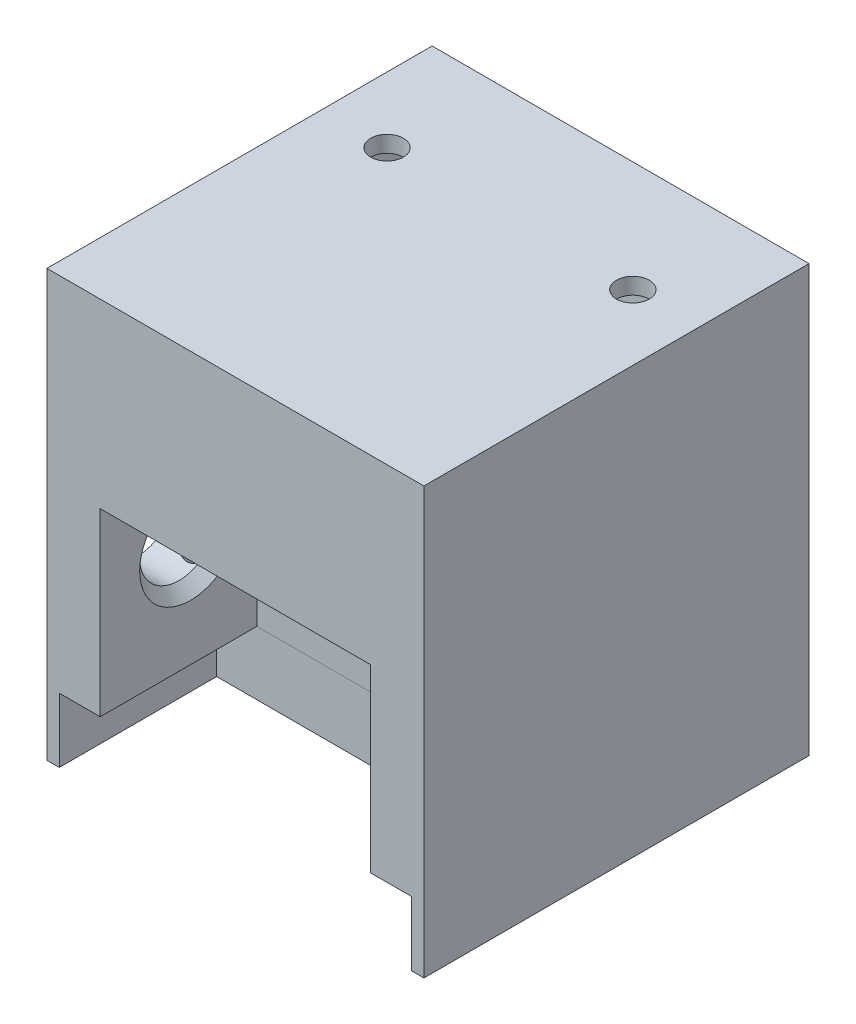
ISO-10303-21;
HEADER;
FILE_DESCRIPTION(('STEP AP214'),'2;1');
FILE_NAME('part.step','',(''),(''),'','','');
FILE_SCHEMA(('AUTOMOTIVE_DESIGN { 1 0 10303 214 1 1 1 1 }'));
ENDSEC;
DATA;
#1=APPLICATION_CONTEXT('core data for automotive mechanical design processes');
#2=APPLICATION_PROTOCOL_DEFINITION('international standard','automotive_design',2000,#1);
#3=PRODUCT_CONTEXT('',#1,'mechanical');
#4=PRODUCT('Part','Part','',(#3));
#5=PRODUCT_RELATED_PRODUCT_CATEGORY('part','',(#4));
#6=PRODUCT_DEFINITION_FORMATION('','',#4);
#7=PRODUCT_DEFINITION_CONTEXT('part definition',#1,'design');
#8=PRODUCT_DEFINITION('design','',#6,#7);
#9=PRODUCT_DEFINITION_SHAPE('','',#8);
#10=(LENGTH_UNIT() NAMED_UNIT(*) SI_UNIT(.MILLI.,.METRE.));
#11=(NAMED_UNIT(*) PLANE_ANGLE_UNIT() SI_UNIT($,.RADIAN.));
#12=(NAMED_UNIT(*) SI_UNIT($,.STERADIAN.) SOLID_ANGLE_UNIT());
#13=UNCERTAINTY_MEASURE_WITH_UNIT(LENGTH_MEASURE(1.E-05),#10,'distance_accuracy_value','');
#14=(GEOMETRIC_REPRESENTATION_CONTEXT(3) GLOBAL_UNCERTAINTY_ASSIGNED_CONTEXT((#13)) GLOBAL_UNIT_ASSIGNED_CONTEXT((#10,
#11,#12)) REPRESENTATION_CONTEXT('',''));
#15=CARTESIAN_POINT('',(0.,0.,0.));
#16=DIRECTION('',(0.,0.,1.));
#17=DIRECTION('',(1.,0.,0.));
#18=AXIS2_PLACEMENT_3D('',#15,#16,#17);
#19=CARTESIAN_POINT('',(0.,63.5,42.545));
#20=DIRECTION('',(0.,0.,-1.));
#21=DIRECTION('',(-1.,0.,0.));
#22=AXIS2_PLACEMENT_3D('',#19,#20,#21);
#23=PLANE('',#22);
#24=DIRECTION('',(1.,0.,0.));
#25=VECTOR('',#24,1.);
#26=CARTESIAN_POINT('',(20.955,9.979406,42.545));
#27=LINE('',#26,#25);
#28=CARTESIAN_POINT('',(20.955,9.979406,42.545));
#29=VERTEX_POINT('',#28);
#30=CARTESIAN_POINT('',(27.305,9.979406,42.545));
#31=VERTEX_POINT('',#30);
#32=EDGE_CURVE('E233',#29,#31,#27,.T.);
#33=ORIENTED_EDGE('',*,*,#32,.T.);
#34=DIRECTION('',(0.,-1.,0.));
#35=VECTOR('',#34,1.);
#36=CARTESIAN_POINT('',(27.305,9.979406,42.545));
#37=LINE('',#36,#35);
#38=CARTESIAN_POINT('',(27.305,0.,42.545));
#39=VERTEX_POINT('',#38);
#40=EDGE_CURVE('E218',#31,#39,#37,.T.);
#41=ORIENTED_EDGE('',*,*,#40,.T.);
#42=DIRECTION('',(1.,0.,0.));
#43=VECTOR('',#42,1.);
#44=CARTESIAN_POINT('',(0.,0.,42.545));
#45=LINE('',#44,#43);
#46=CARTESIAN_POINT('',(29.21,0.,42.545));
#47=VERTEX_POINT('',#46);
#48=EDGE_CURVE('E229',#39,#47,#45,.T.);
#49=ORIENTED_EDGE('',*,*,#48,.T.);
#50=DIRECTION('',(0.,-1.,0.));
#51=VECTOR('',#50,1.);
#52=CARTESIAN_POINT('',(29.21,63.5,42.545));
#53=LINE('',#52,#51);
#54=CARTESIAN_POINT('',(29.21,66.04,42.545));
#55=VERTEX_POINT('',#54);
#56=EDGE_CURVE('E265',#55,#47,#53,.T.);
#57=ORIENTED_EDGE('',*,*,#56,.F.);
#58=DIRECTION('',(1.,0.,0.));
#59=VECTOR('',#58,1.);
#60=CARTESIAN_POINT('',(0.,66.04,42.545));
#61=LINE('',#60,#59);
#62=CARTESIAN_POINT('',(-29.21,66.04,42.545));
#63=VERTEX_POINT('',#62);
#64=EDGE_CURVE('E463',#63,#55,#61,.T.);
#65=ORIENTED_EDGE('',*,*,#64,.F.);
#66=DIRECTION('',(0.,-1.,0.));
#67=VECTOR('',#66,1.);
#68=CARTESIAN_POINT('',(-29.21,63.5,42.545));
#69=LINE('',#68,#67);
#70=CARTESIAN_POINT('',(-29.21,0.,42.545));
#71=VERTEX_POINT('',#70);
#72=EDGE_CURVE('E258',#63,#71,#69,.T.);
#73=ORIENTED_EDGE('',*,*,#72,.T.);
#74=CARTESIAN_POINT('',(-27.305,0.,42.545));
#75=VERTEX_POINT('',#74);
#76=EDGE_CURVE('E242',#71,#75,#45,.T.);
#77=ORIENTED_EDGE('',*,*,#76,.T.);
#78=DIRECTION('',(0.,1.,0.));
#79=VECTOR('',#78,1.);
#80=CARTESIAN_POINT('',(-27.305,0.,42.545));
#81=LINE('',#80,#79);
#82=CARTESIAN_POINT('',(-27.305,9.979406,42.545));
#83=VERTEX_POINT('',#82);
#84=EDGE_CURVE('E234',#75,#83,#81,.T.);
#85=ORIENTED_EDGE('',*,*,#84,.T.);
#86=DIRECTION('',(1.,0.,0.));
#87=VECTOR('',#86,1.);
#88=CARTESIAN_POINT('',(-27.305,9.979406,42.545));
#89=LINE('',#88,#87);
#90=CARTESIAN_POINT('',(-20.955,9.979406,42.545));
#91=VERTEX_POINT('',#90);
#92=EDGE_CURVE('E546',#83,#91,#89,.T.);
#93=ORIENTED_EDGE('',*,*,#92,.T.);
#94=DIRECTION('',(0.,1.,0.));
#95=VECTOR('',#94,1.);
#96=CARTESIAN_POINT('',(-20.955,9.979406,42.545));
#97=LINE('',#96,#95);
#98=CARTESIAN_POINT('',(-20.955,37.919406,42.545));
#99=VERTEX_POINT('',#98);
#100=EDGE_CURVE('E537',#91,#99,#97,.T.);
#101=ORIENTED_EDGE('',*,*,#100,.T.);
#102=DIRECTION('',(1.,0.,0.));
#103=VECTOR('',#102,1.);
#104=CARTESIAN_POINT('',(-20.955,37.919406,42.545));
#105=LINE('',#104,#103);
#106=CARTESIAN_POINT('',(20.955,37.919406,42.545));
#107=VERTEX_POINT('',#106);
#108=EDGE_CURVE('E533',#99,#107,#105,.T.);
#109=ORIENTED_EDGE('',*,*,#108,.T.);
#110=DIRECTION('',(0.,-1.,0.));
#111=VECTOR('',#110,1.);
#112=CARTESIAN_POINT('',(20.955,37.919406,42.545));
#113=LINE('',#112,#111);
#114=EDGE_CURVE('E543',#107,#29,#113,.T.);
#115=ORIENTED_EDGE('',*,*,#114,.T.);
#116=EDGE_LOOP('',(#33,#41,#49,#57,#65,#73,#77,#85,#93,#101,#109,#115));
#117=FACE_BOUND('',#116,.T.);
#118=ADVANCED_FACE('F62',(#117),#23,.F.);
#119=CARTESIAN_POINT('',(29.21,63.5,0.));
#120=DIRECTION('',(-1.,0.,0.));
#121=DIRECTION('',(0.,0.,1.));
#122=AXIS2_PLACEMENT_3D('',#119,#120,#121);
#123=PLANE('',#122);
#124=DIRECTION('',(0.,0.,-1.));
#125=VECTOR('',#124,1.);
#126=CARTESIAN_POINT('',(29.21,0.,0.));
#127=LINE('',#126,#125);
#128=CARTESIAN_POINT('',(29.21,0.,-17.145));
#129=VERTEX_POINT('',#128);
#130=EDGE_CURVE('E240',#47,#129,#127,.T.);
#131=ORIENTED_EDGE('',*,*,#130,.T.);
#132=DIRECTION('',(0.,-1.,0.));
#133=VECTOR('',#132,1.);
#134=CARTESIAN_POINT('',(29.21,63.5,-17.145));
#135=LINE('',#134,#133);
#136=CARTESIAN_POINT('',(29.21,66.04,-17.145));
#137=VERTEX_POINT('',#136);
#138=EDGE_CURVE('E263',#137,#129,#135,.T.);
#139=ORIENTED_EDGE('',*,*,#138,.F.);
#140=DIRECTION('',(0.,0.,-1.));
#141=VECTOR('',#140,1.);
#142=CARTESIAN_POINT('',(29.21,66.04,0.));
#143=LINE('',#142,#141);
#144=EDGE_CURVE('E417',#55,#137,#143,.T.);
#145=ORIENTED_EDGE('',*,*,#144,.F.);
#146=ORIENTED_EDGE('',*,*,#56,.T.);
#147=EDGE_LOOP('',(#131,#139,#145,#146));
#148=FACE_BOUND('',#147,.T.);
#149=ADVANCED_FACE('F360',(#148),#123,.F.);
#150=CARTESIAN_POINT('',(0.,63.5,-17.145));
#151=DIRECTION('',(0.,0.,-1.));
#152=DIRECTION('',(-1.,0.,0.));
#153=AXIS2_PLACEMENT_3D('',#150,#151,#152);
#154=PLANE('',#153);
#155=DIRECTION('',(1.,0.,0.));
#156=VECTOR('',#155,1.);
#157=CARTESIAN_POINT('',(0.,0.,-17.145));
#158=LINE('',#157,#156);
#159=CARTESIAN_POINT('',(-29.21,0.,-17.145));
#160=VERTEX_POINT('',#159);
#161=EDGE_CURVE('E252',#160,#129,#158,.T.);
#162=ORIENTED_EDGE('',*,*,#161,.F.);
#163=DIRECTION('',(0.,-1.,0.));
#164=VECTOR('',#163,1.);
#165=CARTESIAN_POINT('',(-29.21,63.5,-17.145));
#166=LINE('',#165,#164);
#167=CARTESIAN_POINT('',(-29.21,66.04,-17.145));
#168=VERTEX_POINT('',#167);
#169=EDGE_CURVE('E260',#168,#160,#166,.T.);
#170=ORIENTED_EDGE('',*,*,#169,.F.);
#171=DIRECTION('',(-1.,0.,0.));
#172=VECTOR('',#171,1.);
#173=CARTESIAN_POINT('',(0.,66.04,-17.145));
#174=LINE('',#173,#172);
#175=EDGE_CURVE('E411',#137,#168,#174,.T.);
#176=ORIENTED_EDGE('',*,*,#175,.F.);
#177=ORIENTED_EDGE('',*,*,#138,.T.);
#178=EDGE_LOOP('',(#162,#170,#176,#177));
#179=FACE_BOUND('',#178,.T.);
#180=ADVANCED_FACE('F365',(#179),#154,.T.);
#181=CARTESIAN_POINT('',(0.,63.5,12.065));
#182=DIRECTION('',(0.,0.,-1.));
#183=DIRECTION('',(-1.,0.,0.));
#184=AXIS2_PLACEMENT_3D('',#181,#182,#183);
#185=PLANE('',#184);
#186=DIRECTION('',(1.,0.,0.));
#187=VECTOR('',#186,1.);
#188=CARTESIAN_POINT('',(0.,0.,12.065));
#189=LINE('',#188,#187);
#190=CARTESIAN_POINT('',(1.27,0.,12.065));
#191=VERTEX_POINT('',#190);
#192=CARTESIAN_POINT('',(24.13,0.,12.065));
#193=VERTEX_POINT('',#192);
#194=EDGE_CURVE('E426',#191,#193,#189,.T.);
#195=ORIENTED_EDGE('',*,*,#194,.F.);
#196=DIRECTION('',(0.,-1.,0.));
#197=VECTOR('',#196,1.);
#198=CARTESIAN_POINT('',(1.27,63.5,12.065));
#199=LINE('',#198,#197);
#200=CARTESIAN_POINT('',(1.27,63.5,12.065));
#201=VERTEX_POINT('',#200);
#202=EDGE_CURVE('E261',#201,#191,#199,.T.);
#203=ORIENTED_EDGE('',*,*,#202,.F.);
#204=DIRECTION('',(1.,0.,0.));
#205=VECTOR('',#204,1.);
#206=CARTESIAN_POINT('',(0.,63.5,12.065));
#207=LINE('',#206,#205);
#208=CARTESIAN_POINT('',(24.13,63.5,12.065));
#209=VERTEX_POINT('',#208);
#210=EDGE_CURVE('E447',#201,#209,#207,.T.);
#211=ORIENTED_EDGE('',*,*,#210,.T.);
#212=DIRECTION('',(0.,-1.,0.));
#213=VECTOR('',#212,1.);
#214=CARTESIAN_POINT('',(24.13,63.5,12.065));
#215=LINE('',#214,#213);
#216=EDGE_CURVE('E268',#209,#193,#215,.T.);
#217=ORIENTED_EDGE('',*,*,#216,.T.);
#218=EDGE_LOOP('',(#195,#203,#211,#217));
#219=FACE_BOUND('',#218,.T.);
#220=ADVANCED_FACE('F384',(#219),#185,.T.);
#221=CARTESIAN_POINT('',(1.27,63.5,0.));
#222=DIRECTION('',(1.,0.,0.));
#223=DIRECTION('',(0.,0.,-1.));
#224=AXIS2_PLACEMENT_3D('',#221,#222,#223);
#225=PLANE('',#224);
#226=DIRECTION('',(0.,0.,1.));
#227=VECTOR('',#226,1.);
#228=CARTESIAN_POINT('',(1.27,0.,0.));
#229=LINE('',#228,#227);
#230=CARTESIAN_POINT('',(1.27,0.,-12.065));
#231=VERTEX_POINT('',#230);
#232=EDGE_CURVE('E429',#231,#191,#229,.T.);
#233=ORIENTED_EDGE('',*,*,#232,.F.);
#234=DIRECTION('',(0.,-1.,0.));
#235=VECTOR('',#234,1.);
#236=CARTESIAN_POINT('',(1.27,63.5,-12.065));
#237=LINE('',#236,#235);
#238=CARTESIAN_POINT('',(1.27,63.5,-12.065));
#239=VERTEX_POINT('',#238);
#240=EDGE_CURVE('E273',#239,#231,#237,.T.);
#241=ORIENTED_EDGE('',*,*,#240,.F.);
#242=DIRECTION('',(0.,0.,1.));
#243=VECTOR('',#242,1.);
#244=CARTESIAN_POINT('',(1.27,63.5,0.));
#245=LINE('',#244,#243);
#246=EDGE_CURVE('E445',#239,#201,#245,.T.);
#247=ORIENTED_EDGE('',*,*,#246,.T.);
#248=ORIENTED_EDGE('',*,*,#202,.T.);
#249=EDGE_LOOP('',(#233,#241,#247,#248));
#250=FACE_BOUND('',#249,.T.);
#251=ADVANCED_FACE('F380',(#250),#225,.T.);
#252=CARTESIAN_POINT('',(0.,63.5,-12.065));
#253=DIRECTION('',(0.,0.,-1.));
#254=DIRECTION('',(-1.,0.,0.));
#255=AXIS2_PLACEMENT_3D('',#252,#253,#254);
#256=PLANE('',#255);
#257=DIRECTION('',(1.,0.,0.));
#258=VECTOR('',#257,1.);
#259=CARTESIAN_POINT('',(0.,0.,-12.065));
#260=LINE('',#259,#258);
#261=CARTESIAN_POINT('',(24.13,0.,-12.065));
#262=VERTEX_POINT('',#261);
#263=EDGE_CURVE('E247',#231,#262,#260,.T.);
#264=ORIENTED_EDGE('',*,*,#263,.T.);
#265=DIRECTION('',(0.,-1.,0.));
#266=VECTOR('',#265,1.);
#267=CARTESIAN_POINT('',(24.13,63.5,-12.065));
#268=LINE('',#267,#266);
#269=CARTESIAN_POINT('',(24.13,63.5,-12.065));
#270=VERTEX_POINT('',#269);
#271=EDGE_CURVE('E270',#270,#262,#268,.T.);
#272=ORIENTED_EDGE('',*,*,#271,.F.);
#273=DIRECTION('',(1.,0.,0.));
#274=VECTOR('',#273,1.);
#275=CARTESIAN_POINT('',(0.,63.5,-12.065));
#276=LINE('',#275,#274);
#277=EDGE_CURVE('E444',#239,#270,#276,.T.);
#278=ORIENTED_EDGE('',*,*,#277,.F.);
#279=ORIENTED_EDGE('',*,*,#240,.T.);
#280=EDGE_LOOP('',(#264,#272,#278,#279));
#281=FACE_BOUND('',#280,.T.);
#282=ADVANCED_FACE('F376',(#281),#256,.F.);
#283=CARTESIAN_POINT('',(0.,63.5,-12.065));
#284=DIRECTION('',(0.,0.,-1.));
#285=DIRECTION('',(-1.,0.,0.));
#286=AXIS2_PLACEMENT_3D('',#283,#284,#285);
#287=PLANE('',#286);
#288=DIRECTION('',(1.,0.,0.));
#289=VECTOR('',#288,1.);
#290=CARTESIAN_POINT('',(0.,0.,-12.065));
#291=LINE('',#290,#289);
#292=CARTESIAN_POINT('',(-24.13,0.,-12.065));
#293=VERTEX_POINT('',#292);
#294=CARTESIAN_POINT('',(-1.27,0.,-12.065));
#295=VERTEX_POINT('',#294);
#296=EDGE_CURVE('E406',#293,#295,#291,.T.);
#297=ORIENTED_EDGE('',*,*,#296,.T.);
#298=DIRECTION('',(0.,-1.,0.));
#299=VECTOR('',#298,1.);
#300=CARTESIAN_POINT('',(-1.27,63.5,-12.065));
#301=LINE('',#300,#299);
#302=CARTESIAN_POINT('',(-1.27,63.5,-12.065));
#303=VERTEX_POINT('',#302);
#304=EDGE_CURVE('E271',#303,#295,#301,.T.);
#305=ORIENTED_EDGE('',*,*,#304,.F.);
#306=DIRECTION('',(1.,0.,0.));
#307=VECTOR('',#306,1.);
#308=CARTESIAN_POINT('',(0.,63.5,-12.065));
#309=LINE('',#308,#307);
#310=CARTESIAN_POINT('',(-24.13,63.5,-12.065));
#311=VERTEX_POINT('',#310);
#312=EDGE_CURVE('E257',#311,#303,#309,.T.);
#313=ORIENTED_EDGE('',*,*,#312,.F.);
#314=DIRECTION('',(0.,-1.,0.));
#315=VECTOR('',#314,1.);
#316=CARTESIAN_POINT('',(-24.13,63.5,-12.065));
#317=LINE('',#316,#315);
#318=EDGE_CURVE('E276',#311,#293,#317,.T.);
#319=ORIENTED_EDGE('',*,*,#318,.T.);
#320=EDGE_LOOP('',(#297,#305,#313,#319));
#321=FACE_BOUND('',#320,.T.);
#322=ADVANCED_FACE('F379',(#321),#287,.F.);
#323=CARTESIAN_POINT('',(-1.27,63.5,0.));
#324=DIRECTION('',(1.,0.,0.));
#325=DIRECTION('',(0.,0.,-1.));
#326=AXIS2_PLACEMENT_3D('',#323,#324,#325);
#327=PLANE('',#326);
#328=DIRECTION('',(0.,0.,1.));
#329=VECTOR('',#328,1.);
#330=CARTESIAN_POINT('',(-1.27,0.,0.));
#331=LINE('',#330,#329);
#332=CARTESIAN_POINT('',(-1.27,0.,12.065));
#333=VERTEX_POINT('',#332);
#334=EDGE_CURVE('E410',#295,#333,#331,.T.);
#335=ORIENTED_EDGE('',*,*,#334,.T.);
#336=DIRECTION('',(0.,-1.,0.));
#337=VECTOR('',#336,1.);
#338=CARTESIAN_POINT('',(-1.27,63.5,12.065));
#339=LINE('',#338,#337);
#340=CARTESIAN_POINT('',(-1.27,63.5,12.065));
#341=VERTEX_POINT('',#340);
#342=EDGE_CURVE('E282',#341,#333,#339,.T.);
#343=ORIENTED_EDGE('',*,*,#342,.F.);
#344=DIRECTION('',(0.,0.,1.));
#345=VECTOR('',#344,1.);
#346=CARTESIAN_POINT('',(-1.27,63.5,0.));
#347=LINE('',#346,#345);
#348=EDGE_CURVE('E457',#303,#341,#347,.T.);
#349=ORIENTED_EDGE('',*,*,#348,.F.);
#350=ORIENTED_EDGE('',*,*,#304,.T.);
#351=EDGE_LOOP('',(#335,#343,#349,#350));
#352=FACE_BOUND('',#351,.T.);
#353=ADVANCED_FACE('F395',(#352),#327,.F.);
#354=CARTESIAN_POINT('',(0.,63.5,12.065));
#355=DIRECTION('',(0.,0.,-1.));
#356=DIRECTION('',(-1.,0.,0.));
#357=AXIS2_PLACEMENT_3D('',#354,#355,#356);
#358=PLANE('',#357);
#359=DIRECTION('',(1.,0.,0.));
#360=VECTOR('',#359,1.);
#361=CARTESIAN_POINT('',(0.,0.,12.065));
#362=LINE('',#361,#360);
#363=CARTESIAN_POINT('',(-24.13,0.,12.065));
#364=VERTEX_POINT('',#363);
#365=EDGE_CURVE('E414',#364,#333,#362,.T.);
#366=ORIENTED_EDGE('',*,*,#365,.F.);
#367=DIRECTION('',(0.,-1.,0.));
#368=VECTOR('',#367,1.);
#369=CARTESIAN_POINT('',(-24.13,63.5,12.065));
#370=LINE('',#369,#368);
#371=CARTESIAN_POINT('',(-24.13,63.5,12.065));
#372=VERTEX_POINT('',#371);
#373=EDGE_CURVE('E279',#372,#364,#370,.T.);
#374=ORIENTED_EDGE('',*,*,#373,.F.);
#375=DIRECTION('',(1.,0.,0.));
#376=VECTOR('',#375,1.);
#377=CARTESIAN_POINT('',(0.,63.5,12.065));
#378=LINE('',#377,#376);
#379=EDGE_CURVE('E454',#372,#341,#378,.T.);
#380=ORIENTED_EDGE('',*,*,#379,.T.);
#381=ORIENTED_EDGE('',*,*,#342,.T.);
#382=EDGE_LOOP('',(#366,#374,#380,#381));
#383=FACE_BOUND('',#382,.T.);
#384=ADVANCED_FACE('F374',(#383),#358,.T.);
#385=CARTESIAN_POINT('',(24.13,63.5,0.));
#386=DIRECTION('',(-1.,0.,0.));
#387=DIRECTION('',(0.,0.,1.));
#388=AXIS2_PLACEMENT_3D('',#385,#386,#387);
#389=PLANE('',#388);
#390=DIRECTION('',(0.,0.,-1.));
#391=VECTOR('',#390,1.);
#392=CARTESIAN_POINT('',(24.13,0.,0.));
#393=LINE('',#392,#391);
#394=EDGE_CURVE('E243',#193,#262,#393,.T.);
#395=ORIENTED_EDGE('',*,*,#394,.F.);
#396=ORIENTED_EDGE('',*,*,#216,.F.);
#397=DIRECTION('',(0.,0.,-1.));
#398=VECTOR('',#397,1.);
#399=CARTESIAN_POINT('',(24.13,63.5,0.));
#400=LINE('',#399,#398);
#401=EDGE_CURVE('E280',#209,#270,#400,.T.);
#402=ORIENTED_EDGE('',*,*,#401,.T.);
#403=ORIENTED_EDGE('',*,*,#271,.T.);
#404=EDGE_LOOP('',(#395,#396,#402,#403));
#405=FACE_BOUND('',#404,.T.);
#406=ADVANCED_FACE('F370',(#405),#389,.T.);
#407=CARTESIAN_POINT('',(-24.13,63.5,0.));
#408=DIRECTION('',(-1.,0.,0.));
#409=DIRECTION('',(0.,0.,1.));
#410=AXIS2_PLACEMENT_3D('',#407,#408,#409);
#411=PLANE('',#410);
#412=DIRECTION('',(0.,0.,-1.));
#413=VECTOR('',#412,1.);
#414=CARTESIAN_POINT('',(-24.13,0.,0.));
#415=LINE('',#414,#413);
#416=EDGE_CURVE('E424',#364,#293,#415,.T.);
#417=ORIENTED_EDGE('',*,*,#416,.T.);
#418=ORIENTED_EDGE('',*,*,#318,.F.);
#419=DIRECTION('',(0.,0.,-1.));
#420=VECTOR('',#419,1.);
#421=CARTESIAN_POINT('',(-24.13,63.5,0.));
#422=LINE('',#421,#420);
#423=EDGE_CURVE('E451',#372,#311,#422,.T.);
#424=ORIENTED_EDGE('',*,*,#423,.F.);
#425=ORIENTED_EDGE('',*,*,#373,.T.);
#426=EDGE_LOOP('',(#417,#418,#424,#425));
#427=FACE_BOUND('',#426,.T.);
#428=ADVANCED_FACE('F373',(#427),#411,.F.);
#429=CARTESIAN_POINT('',(-29.21,63.5,0.));
#430=DIRECTION('',(-1.,0.,0.));
#431=DIRECTION('',(0.,0.,1.));
#432=AXIS2_PLACEMENT_3D('',#429,#430,#431);
#433=PLANE('',#432);
#434=CARTESIAN_POINT('',(-29.21,26.477976,28.5572274456381));
#435=DIRECTION('',(1.,0.,0.));
#436=DIRECTION('',(0.,0.,-1.));
#437=AXIS2_PLACEMENT_3D('',#434,#435,#436);
#438=CIRCLE('',#437,6.096);
#439=CARTESIAN_POINT('',(-29.21,26.477976,22.4612274456381));
#440=VERTEX_POINT('',#439);
#441=EDGE_CURVE('E550',#440,#440,#438,.T.);
#442=ORIENTED_EDGE('',*,*,#441,.T.);
#443=EDGE_LOOP('',(#442));
#444=FACE_BOUND('',#443,.T.);
#445=DIRECTION('',(0.,0.,-1.));
#446=VECTOR('',#445,1.);
#447=CARTESIAN_POINT('',(-29.21,0.,0.));
#448=LINE('',#447,#446);
#449=EDGE_CURVE('E254',#71,#160,#448,.T.);
#450=ORIENTED_EDGE('',*,*,#449,.F.);
#451=ORIENTED_EDGE('',*,*,#72,.F.);
#452=DIRECTION('',(0.,0.,1.));
#453=VECTOR('',#452,1.);
#454=CARTESIAN_POINT('',(-29.21,66.04,0.));
#455=LINE('',#454,#453);
#456=EDGE_CURVE('E466',#168,#63,#455,.T.);
#457=ORIENTED_EDGE('',*,*,#456,.F.);
#458=ORIENTED_EDGE('',*,*,#169,.T.);
#459=EDGE_LOOP('',(#450,#451,#457,#458));
#460=FACE_BOUND('',#459,.T.);
#461=ADVANCED_FACE('F391',(#444,#460),#433,.T.);
#462=CARTESIAN_POINT('',(0.,0.,0.));
#463=DIRECTION('',(0.,1.,0.));
#464=DIRECTION('',(0.,0.,1.));
#465=AXIS2_PLACEMENT_3D('',#462,#463,#464);
#466=PLANE('',#465);
#467=ORIENTED_EDGE('',*,*,#48,.F.);
#468=DIRECTION('',(0.,0.,1.));
#469=VECTOR('',#468,1.);
#470=CARTESIAN_POINT('',(27.305,0.,38.9712274456381));
#471=LINE('',#470,#469);
#472=CARTESIAN_POINT('',(27.305,0.,18.1432274456381));
#473=VERTEX_POINT('',#472);
#474=EDGE_CURVE('E214',#473,#39,#471,.T.);
#475=ORIENTED_EDGE('',*,*,#474,.F.);
#476=DIRECTION('',(1.,0.,0.));
#477=VECTOR('',#476,1.);
#478=CARTESIAN_POINT('',(-27.305,0.,18.1432274456381));
#479=LINE('',#478,#477);
#480=CARTESIAN_POINT('',(-27.305,0.,18.1432274456381));
#481=VERTEX_POINT('',#480);
#482=EDGE_CURVE('E226',#481,#473,#479,.T.);
#483=ORIENTED_EDGE('',*,*,#482,.F.);
#484=DIRECTION('',(0.,0.,-1.));
#485=VECTOR('',#484,1.);
#486=CARTESIAN_POINT('',(-27.305,0.,38.9712274456381));
#487=LINE('',#486,#485);
#488=EDGE_CURVE('E487',#75,#481,#487,.T.);
#489=ORIENTED_EDGE('',*,*,#488,.F.);
#490=ORIENTED_EDGE('',*,*,#76,.F.);
#491=ORIENTED_EDGE('',*,*,#449,.T.);
#492=ORIENTED_EDGE('',*,*,#161,.T.);
#493=ORIENTED_EDGE('',*,*,#130,.F.);
#494=EDGE_LOOP('',(#467,#475,#483,#489,#490,#491,#492,#493));
#495=FACE_BOUND('',#494,.T.);
#496=ORIENTED_EDGE('',*,*,#296,.F.);
#497=ORIENTED_EDGE('',*,*,#416,.F.);
#498=ORIENTED_EDGE('',*,*,#365,.T.);
#499=ORIENTED_EDGE('',*,*,#334,.F.);
#500=EDGE_LOOP('',(#496,#497,#498,#499));
#501=FACE_BOUND('',#500,.T.);
#502=ORIENTED_EDGE('',*,*,#194,.T.);
#503=ORIENTED_EDGE('',*,*,#394,.T.);
#504=ORIENTED_EDGE('',*,*,#263,.F.);
#505=ORIENTED_EDGE('',*,*,#232,.T.);
#506=EDGE_LOOP('',(#502,#503,#504,#505));
#507=FACE_BOUND('',#506,.T.);
#508=ADVANCED_FACE('F236',(#495,#501,#507),#466,.F.);
#509=CARTESIAN_POINT('',(0.,63.5,0.));
#510=DIRECTION('',(0.,1.,0.));
#511=DIRECTION('',(0.,0.,1.));
#512=AXIS2_PLACEMENT_3D('',#509,#510,#511);
#513=PLANE('',#512);
#514=CARTESIAN_POINT('',(19.05,63.5,0.));
#515=DIRECTION('',(0.,1.,0.));
#516=DIRECTION('',(0.,0.,1.));
#517=AXIS2_PLACEMENT_3D('',#514,#515,#516);
#518=CIRCLE('',#517,2.54);
#519=CARTESIAN_POINT('',(19.05,63.5,2.54));
#520=VERTEX_POINT('',#519);
#521=EDGE_CURVE('E472',#520,#520,#518,.T.);
#522=ORIENTED_EDGE('',*,*,#521,.T.);
#523=EDGE_LOOP('',(#522));
#524=FACE_BOUND('',#523,.T.);
#525=ORIENTED_EDGE('',*,*,#210,.F.);
#526=ORIENTED_EDGE('',*,*,#246,.F.);
#527=ORIENTED_EDGE('',*,*,#277,.T.);
#528=ORIENTED_EDGE('',*,*,#401,.F.);
#529=EDGE_LOOP('',(#525,#526,#527,#528));
#530=FACE_BOUND('',#529,.T.);
#531=ADVANCED_FACE('F602',(#524,#530),#513,.F.);
#532=CARTESIAN_POINT('',(-19.05,63.5,0.));
#533=DIRECTION('',(0.,1.,0.));
#534=DIRECTION('',(0.,0.,1.));
#535=AXIS2_PLACEMENT_3D('',#532,#533,#534);
#536=CIRCLE('',#535,2.54);
#537=CARTESIAN_POINT('',(-19.05,63.5,2.54));
#538=VERTEX_POINT('',#537);
#539=EDGE_CURVE('E469',#538,#538,#536,.T.);
#540=ORIENTED_EDGE('',*,*,#539,.T.);
#541=EDGE_LOOP('',(#540));
#542=FACE_BOUND('',#541,.T.);
#543=ORIENTED_EDGE('',*,*,#423,.T.);
#544=ORIENTED_EDGE('',*,*,#312,.T.);
#545=ORIENTED_EDGE('',*,*,#348,.T.);
#546=ORIENTED_EDGE('',*,*,#379,.F.);
#547=EDGE_LOOP('',(#543,#544,#545,#546));
#548=FACE_BOUND('',#547,.T.);
#549=ADVANCED_FACE('F600',(#542,#548),#513,.F.);
#550=CARTESIAN_POINT('',(0.,66.04,0.));
#551=DIRECTION('',(0.,1.,0.));
#552=DIRECTION('',(0.,0.,1.));
#553=AXIS2_PLACEMENT_3D('',#550,#551,#552);
#554=PLANE('',#553);
#555=CARTESIAN_POINT('',(-19.05,66.04,0.));
#556=DIRECTION('',(0.,1.,0.));
#557=DIRECTION('',(0.,0.,1.));
#558=AXIS2_PLACEMENT_3D('',#555,#556,#557);
#559=CIRCLE('',#558,2.54);
#560=CARTESIAN_POINT('',(-19.05,66.04,2.54));
#561=VERTEX_POINT('',#560);
#562=EDGE_CURVE('E475',#561,#561,#559,.T.);
#563=ORIENTED_EDGE('',*,*,#562,.F.);
#564=EDGE_LOOP('',(#563));
#565=FACE_BOUND('',#564,.T.);
#566=CARTESIAN_POINT('',(19.05,66.04,0.));
#567=DIRECTION('',(0.,1.,0.));
#568=DIRECTION('',(0.,0.,1.));
#569=AXIS2_PLACEMENT_3D('',#566,#567,#568);
#570=CIRCLE('',#569,2.54);
#571=CARTESIAN_POINT('',(19.05,66.04,2.54));
#572=VERTEX_POINT('',#571);
#573=EDGE_CURVE('E476',#572,#572,#570,.T.);
#574=ORIENTED_EDGE('',*,*,#573,.F.);
#575=EDGE_LOOP('',(#574));
#576=FACE_BOUND('',#575,.T.);
#577=ORIENTED_EDGE('',*,*,#456,.T.);
#578=ORIENTED_EDGE('',*,*,#64,.T.);
#579=ORIENTED_EDGE('',*,*,#144,.T.);
#580=ORIENTED_EDGE('',*,*,#175,.T.);
#581=EDGE_LOOP('',(#577,#578,#579,#580));
#582=FACE_BOUND('',#581,.T.);
#583=ADVANCED_FACE('F596',(#565,#576,#582),#554,.T.);
#584=CARTESIAN_POINT('',(19.05,0.,0.));
#585=DIRECTION('',(0.,1.,0.));
#586=DIRECTION('',(0.,0.,1.));
#587=AXIS2_PLACEMENT_3D('',#584,#585,#586);
#588=CYLINDRICAL_SURFACE('',#587,2.54);
#589=ORIENTED_EDGE('',*,*,#573,.T.);
#590=EDGE_LOOP('',(#589));
#591=FACE_BOUND('',#590,.T.);
#592=ORIENTED_EDGE('',*,*,#521,.F.);
#593=EDGE_LOOP('',(#592));
#594=FACE_BOUND('',#593,.T.);
#595=ADVANCED_FACE('F592',(#591,#594),#588,.F.);
#596=CARTESIAN_POINT('',(-19.05,0.,0.));
#597=DIRECTION('',(0.,1.,0.));
#598=DIRECTION('',(0.,0.,1.));
#599=AXIS2_PLACEMENT_3D('',#596,#597,#598);
#600=CYLINDRICAL_SURFACE('',#599,2.54);
#601=ORIENTED_EDGE('',*,*,#562,.T.);
#602=EDGE_LOOP('',(#601));
#603=FACE_BOUND('',#602,.T.);
#604=ORIENTED_EDGE('',*,*,#539,.F.);
#605=EDGE_LOOP('',(#604));
#606=FACE_BOUND('',#605,.T.);
#607=ADVANCED_FACE('F588',(#603,#606),#600,.F.);
#608=CARTESIAN_POINT('',(-27.305,9.979406,38.9712274456381));
#609=DIRECTION('',(-1.,0.,0.));
#610=DIRECTION('',(0.,0.,1.));
#611=AXIS2_PLACEMENT_3D('',#608,#609,#610);
#612=PLANE('',#611);
#613=DIRECTION('',(0.,-1.,0.));
#614=VECTOR('',#613,1.);
#615=CARTESIAN_POINT('',(-27.305,9.979406,18.1432274456381));
#616=LINE('',#615,#614);
#617=CARTESIAN_POINT('',(-27.305,9.979406,18.1432274456381));
#618=VERTEX_POINT('',#617);
#619=EDGE_CURVE('E481',#618,#481,#616,.T.);
#620=ORIENTED_EDGE('',*,*,#619,.F.);
#621=DIRECTION('',(0.,0.,-1.));
#622=VECTOR('',#621,1.);
#623=CARTESIAN_POINT('',(-27.305,9.979406,38.9712274456381));
#624=LINE('',#623,#622);
#625=EDGE_CURVE('E225',#83,#618,#624,.T.);
#626=ORIENTED_EDGE('',*,*,#625,.F.);
#627=ORIENTED_EDGE('',*,*,#84,.F.);
#628=ORIENTED_EDGE('',*,*,#488,.T.);
#629=EDGE_LOOP('',(#620,#626,#627,#628));
#630=FACE_BOUND('',#629,.T.);
#631=ADVANCED_FACE('F582',(#630),#612,.F.);
#632=CARTESIAN_POINT('',(27.305,9.979406,38.9712274456381));
#633=DIRECTION('',(1.,0.,0.));
#634=DIRECTION('',(0.,0.,-1.));
#635=AXIS2_PLACEMENT_3D('',#632,#633,#634);
#636=PLANE('',#635);
#637=ORIENTED_EDGE('',*,*,#474,.T.);
#638=ORIENTED_EDGE('',*,*,#40,.F.);
#639=DIRECTION('',(0.,0.,1.));
#640=VECTOR('',#639,1.);
#641=CARTESIAN_POINT('',(27.305,9.979406,38.9712274456381));
#642=LINE('',#641,#640);
#643=CARTESIAN_POINT('',(27.305,9.979406,18.1432274456381));
#644=VERTEX_POINT('',#643);
#645=EDGE_CURVE('E484',#644,#31,#642,.T.);
#646=ORIENTED_EDGE('',*,*,#645,.F.);
#647=DIRECTION('',(0.,-1.,0.));
#648=VECTOR('',#647,1.);
#649=CARTESIAN_POINT('',(27.305,9.979406,18.1432274456381));
#650=LINE('',#649,#648);
#651=EDGE_CURVE('E220',#644,#473,#650,.T.);
#652=ORIENTED_EDGE('',*,*,#651,.T.);
#653=EDGE_LOOP('',(#637,#638,#646,#652));
#654=FACE_BOUND('',#653,.T.);
#655=ADVANCED_FACE('F216',(#654),#636,.F.);
#656=CARTESIAN_POINT('',(-27.305,9.979406,18.1432274456381));
#657=DIRECTION('',(0.,0.,-1.));
#658=DIRECTION('',(-1.,0.,0.));
#659=AXIS2_PLACEMENT_3D('',#656,#657,#658);
#660=PLANE('',#659);
#661=ORIENTED_EDGE('',*,*,#482,.T.);
#662=ORIENTED_EDGE('',*,*,#651,.F.);
#663=DIRECTION('',(1.,0.,0.));
#664=VECTOR('',#663,1.);
#665=CARTESIAN_POINT('',(-27.305,9.979406,18.1432274456381));
#666=LINE('',#665,#664);
#667=EDGE_CURVE('E491',#618,#644,#666,.T.);
#668=ORIENTED_EDGE('',*,*,#667,.F.);
#669=ORIENTED_EDGE('',*,*,#619,.T.);
#670=EDGE_LOOP('',(#661,#662,#668,#669));
#671=FACE_BOUND('',#670,.T.);
#672=ADVANCED_FACE('F354',(#671),#660,.F.);
#673=CARTESIAN_POINT('',(0.,9.979406,0.));
#674=DIRECTION('',(0.,-1.,0.));
#675=DIRECTION('',(0.,0.,-1.));
#676=AXIS2_PLACEMENT_3D('',#673,#674,#675);
#677=PLANE('',#676);
#678=CARTESIAN_POINT('',(24.09,9.979406,36.9308597875787));
#679=DIRECTION('',(0.,-1.,0.));
#680=DIRECTION('',(0.,0.,-1.));
#681=AXIS2_PLACEMENT_3D('',#678,#679,#680);
#682=CIRCLE('',#681,2.2352);
#683=CARTESIAN_POINT('',(24.09,9.979406,34.6956597875787));
#684=VERTEX_POINT('',#683);
#685=EDGE_CURVE('E267',#684,#684,#682,.T.);
#686=ORIENTED_EDGE('',*,*,#685,.F.);
#687=EDGE_LOOP('',(#686));
#688=FACE_BOUND('',#687,.T.);
#689=CARTESIAN_POINT('',(-24.09,9.979406,36.9308597875787));
#690=DIRECTION('',(0.,-1.,0.));
#691=DIRECTION('',(0.,0.,-1.));
#692=AXIS2_PLACEMENT_3D('',#689,#690,#691);
#693=CIRCLE('',#692,2.2352);
#694=CARTESIAN_POINT('',(-24.09,9.979406,34.6956597875787));
#695=VERTEX_POINT('',#694);
#696=EDGE_CURVE('E288',#695,#695,#693,.T.);
#697=ORIENTED_EDGE('',*,*,#696,.F.);
#698=EDGE_LOOP('',(#697));
#699=FACE_BOUND('',#698,.T.);
#700=ORIENTED_EDGE('',*,*,#32,.F.);
#701=DIRECTION('',(0.,0.,1.));
#702=VECTOR('',#701,1.);
#703=CARTESIAN_POINT('',(20.955,9.979406,18.2702274456381));
#704=LINE('',#703,#702);
#705=CARTESIAN_POINT('',(20.955,9.979406,18.2702274456381));
#706=VERTEX_POINT('',#705);
#707=EDGE_CURVE('E521',#706,#29,#704,.T.);
#708=ORIENTED_EDGE('',*,*,#707,.F.);
#709=DIRECTION('',(1.,0.,0.));
#710=VECTOR('',#709,1.);
#711=CARTESIAN_POINT('',(20.955,9.979406,18.2702274456381));
#712=LINE('',#711,#710);
#713=CARTESIAN_POINT('',(-20.955,9.979406,18.2702274456381));
#714=VERTEX_POINT('',#713);
#715=EDGE_CURVE('E523',#714,#706,#712,.T.);
#716=ORIENTED_EDGE('',*,*,#715,.F.);
#717=DIRECTION('',(0.,0.,-1.));
#718=VECTOR('',#717,1.);
#719=CARTESIAN_POINT('',(-20.955,9.979406,18.2702274456381));
#720=LINE('',#719,#718);
#721=EDGE_CURVE('E319',#91,#714,#720,.T.);
#722=ORIENTED_EDGE('',*,*,#721,.F.);
#723=ORIENTED_EDGE('',*,*,#92,.F.);
#724=ORIENTED_EDGE('',*,*,#625,.T.);
#725=ORIENTED_EDGE('',*,*,#667,.T.);
#726=ORIENTED_EDGE('',*,*,#645,.T.);
#727=EDGE_LOOP('',(#700,#708,#716,#722,#723,#724,#725,#726));
#728=FACE_BOUND('',#727,.T.);
#729=CARTESIAN_POINT('',(-24.09,9.979406,23.7573676580594));
#730=DIRECTION('',(0.,-1.,0.));
#731=DIRECTION('',(0.,0.,-1.));
#732=AXIS2_PLACEMENT_3D('',#729,#730,#731);
#733=CIRCLE('',#732,2.2352);
#734=CARTESIAN_POINT('',(-24.09,9.979406,21.5221676580594));
#735=VERTEX_POINT('',#734);
#736=EDGE_CURVE('E505',#735,#735,#733,.T.);
#737=ORIENTED_EDGE('',*,*,#736,.F.);
#738=EDGE_LOOP('',(#737));
#739=FACE_BOUND('',#738,.T.);
#740=CARTESIAN_POINT('',(24.09,9.979406,23.7573676580594));
#741=DIRECTION('',(0.,-1.,0.));
#742=DIRECTION('',(0.,0.,-1.));
#743=AXIS2_PLACEMENT_3D('',#740,#741,#742);
#744=CIRCLE('',#743,2.2352);
#745=CARTESIAN_POINT('',(24.09,9.979406,21.5221676580594));
#746=VERTEX_POINT('',#745);
#747=EDGE_CURVE('E511',#746,#746,#744,.T.);
#748=ORIENTED_EDGE('',*,*,#747,.F.);
#749=EDGE_LOOP('',(#748));
#750=FACE_BOUND('',#749,.T.);
#751=ADVANCED_FACE('F349',(#688,#699,#728,#739,#750),#677,.T.);
#752=CARTESIAN_POINT('',(24.09,22.679406,23.7573676580594));
#753=DIRECTION('',(0.,-1.,0.));
#754=DIRECTION('',(0.,0.,-1.));
#755=AXIS2_PLACEMENT_3D('',#752,#753,#754);
#756=CYLINDRICAL_SURFACE('',#755,2.2352);
#757=CARTESIAN_POINT('',(24.09,22.679406,23.7573676580594));
#758=DIRECTION('',(0.,-1.,0.));
#759=DIRECTION('',(0.,0.,-1.));
#760=AXIS2_PLACEMENT_3D('',#757,#758,#759);
#761=CIRCLE('',#760,2.2352);
#762=CARTESIAN_POINT('',(24.09,22.679406,21.5221676580594));
#763=VERTEX_POINT('',#762);
#764=EDGE_CURVE('E499',#763,#763,#761,.T.);
#765=ORIENTED_EDGE('',*,*,#764,.F.);
#766=EDGE_LOOP('',(#765));
#767=FACE_BOUND('',#766,.T.);
#768=ORIENTED_EDGE('',*,*,#747,.T.);
#769=EDGE_LOOP('',(#768));
#770=FACE_BOUND('',#769,.T.);
#771=ADVANCED_FACE('F346',(#767,#770),#756,.F.);
#772=CARTESIAN_POINT('',(24.09,22.679406,23.7573676580594));
#773=DIRECTION('',(0.,-1.,0.));
#774=DIRECTION('',(0.,0.,-1.));
#775=AXIS2_PLACEMENT_3D('',#772,#773,#774);
#776=PLANE('',#775);
#777=ORIENTED_EDGE('',*,*,#764,.T.);
#778=EDGE_LOOP('',(#777));
#779=FACE_BOUND('',#778,.T.);
#780=ADVANCED_FACE('F304',(#779),#776,.T.);
#781=CARTESIAN_POINT('',(-24.09,22.679406,23.7573676580594));
#782=DIRECTION('',(0.,-1.,0.));
#783=DIRECTION('',(0.,0.,-1.));
#784=AXIS2_PLACEMENT_3D('',#781,#782,#783);
#785=CYLINDRICAL_SURFACE('',#784,2.2352);
#786=CARTESIAN_POINT('',(-26.3249703174742,22.679406,23.7894101300208));
#787=CARTESIAN_POINT('',(-26.3241222932189,22.6057680086295,23.8480595746238));
#788=CARTESIAN_POINT('',(-26.3209523264537,22.5334840428121,23.9084556599826));
#789=CARTESIAN_POINT('',(-26.309091046164,22.3918893952194,24.032413683383));
#790=CARTESIAN_POINT('',(-26.3003877893328,22.3225854920701,24.0959821947518));
#791=CARTESIAN_POINT('',(-26.2764807386312,22.1869836777038,24.226232838537));
#792=CARTESIAN_POINT('',(-26.2612240890001,22.120715164631,24.2929362727579));
#793=CARTESIAN_POINT('',(-26.223333135198,21.992381386016,24.4281419744091));
#794=CARTESIAN_POINT('',(-26.2007057409723,21.9303122491968,24.4966425020061));
#795=CARTESIAN_POINT('',(-26.1350688484985,21.783728208503,24.6658567265049));
#796=CARTESIAN_POINT('',(-26.0874696143516,21.7017859587888,24.7671030243699));
#797=CARTESIAN_POINT('',(-25.9730653621162,21.5497148235029,24.9670747278348));
#798=CARTESIAN_POINT('',(-25.9063275179218,21.4795459571473,25.0658076578025));
#799=CARTESIAN_POINT('',(-25.7522700687172,21.3514407085883,25.2567445521152));
#800=CARTESIAN_POINT('',(-25.6647816527496,21.2936124668544,25.3488864400164));
#801=CARTESIAN_POINT('',(-25.4707005778356,21.1916002278284,25.5198913514255));
#802=CARTESIAN_POINT('',(-25.3641010843917,21.147421127181,25.5987496048114));
#803=CARTESIAN_POINT('',(-25.1485523895894,21.0770069273254,25.729572306329));
#804=CARTESIAN_POINT('',(-25.041339973812,21.0492764156312,25.7836046511452));
#805=CARTESIAN_POINT('',(-24.8178002449767,21.0039349119438,25.8741928540292));
#806=CARTESIAN_POINT('',(-24.7014772428811,20.9863191663124,25.9107569203069));
#807=CARTESIAN_POINT('',(-24.4704787058195,20.9614846359357,25.9629403761377));
#808=CARTESIAN_POINT('',(-24.3561109515984,20.9537137089463,25.9796683059947));
#809=CARTESIAN_POINT('',(-24.1259067870154,20.9464677936355,25.9952532671067));
#810=CARTESIAN_POINT('',(-24.010070544852,20.9469918636438,25.994112326884));
#811=CARTESIAN_POINT('',(-23.781629332725,20.95629833606,25.9741273263375));
#812=CARTESIAN_POINT('',(-23.6690025038012,20.9649854241284,25.95548759061));
#813=CARTESIAN_POINT('',(-23.4487989741864,20.9907311365276,25.9016215533105));
#814=CARTESIAN_POINT('',(-23.3412218083681,21.0077889881582,25.8663967827057));
#815=CARTESIAN_POINT('',(-23.1338099300571,21.0507147642183,25.7808389224315));
#816=CARTESIAN_POINT('',(-23.0339958766526,21.076605270908,25.7304671462698));
#817=CARTESIAN_POINT('',(-22.8449764796079,21.1375317996188,25.6169888672255));
#818=CARTESIAN_POINT('',(-22.7557722607139,21.1725687900009,25.5538810161034));
#819=CARTESIAN_POINT('',(-22.5879208673415,21.2528417076214,25.4162625114393));
#820=CARTESIAN_POINT('',(-22.5095711642649,21.298298029012,25.3415186759612));
#821=CARTESIAN_POINT('',(-22.3670945654186,21.3986333804381,25.1852689066311));
#822=CARTESIAN_POINT('',(-22.3029628229781,21.4535091881717,25.1037652901368));
#823=CARTESIAN_POINT('',(-22.1844950499569,21.5766959547547,24.9308255403364));
#824=CARTESIAN_POINT('',(-22.1313170600831,21.6457219233072,24.8391110749777));
#825=CARTESIAN_POINT('',(-22.0404256205456,21.7930432219626,24.6551063873459));
#826=CARTESIAN_POINT('',(-22.0027543906048,21.8713631200797,24.5628152787323));
#827=CARTESIAN_POINT('',(-21.9516070501834,22.0082645153749,24.4111942752936));
#828=CARTESIAN_POINT('',(-21.9342526016772,22.0646889835992,24.3511620612639));
#829=CARTESIAN_POINT('',(-21.9050813948972,22.1806745677323,24.2327293742897));
#830=CARTESIAN_POINT('',(-21.8932680733162,22.2402376048273,24.174329935074));
#831=CARTESIAN_POINT('',(-21.874634707958,22.3617356835805,24.0600402730402));
#832=CARTESIAN_POINT('',(-21.8677839521746,22.4236535957291,24.0041366615263));
#833=CARTESIAN_POINT('',(-21.858359848708,22.5498289539,23.8948396523349));
#834=CARTESIAN_POINT('',(-21.8557803046945,22.6140828723909,23.8414427277014));
#835=CARTESIAN_POINT('',(-21.8550296825258,22.679406,23.7894101300208));
#836=B_SPLINE_CURVE_WITH_KNOTS('',3,(#786,#787,#788,#789,#790,#791,#792,#793,#794,#795,#796,
#797,#798,#799,#800,#801,#802,#803,#804,#805,#806,#807,#808,#809,#810,#811,#812,#813,#814,#815,
#816,#817,#818,#819,#820,#821,#822,#823,#824,#825,#826,#827,#828,#829,#830,#831,#832,#833,#834,
#835),.UNSPECIFIED.,.F.,.F.,(4,2,2,2,2,2,2,2,2,2,2,2,2,2,2,2,2,2,2,2,2,2,2,2,4),(0.,
0.282450918948161,0.565513572316931,0.850903419736013,1.13602648542703,1.55033933205601,
1.96321543169067,2.37957312582021,2.79608001575724,3.16381549164331,3.53137800108142,
3.87725246824605,4.2230876710936,4.56493430279679,4.90674938476846,5.24944501000892,
5.59217693201787,5.94296579199201,6.29363488927386,6.67172339221818,7.0508346014466,
7.30317617843659,7.55567405531497,7.80659561933112,8.0571528465809),.UNSPECIFIED.);
#837=CARTESIAN_POINT('',(-26.3249703174742,22.679406,23.7894101300208));
#838=VERTEX_POINT('',#837);
#839=CARTESIAN_POINT('',(-22.733,21.1847417243397,25.5335067404514));
#840=VERTEX_POINT('',#839);
#841=EDGE_CURVE('E311',#838,#840,#836,.T.);
#842=ORIENTED_EDGE('',*,*,#841,.T.);
#843=CARTESIAN_POINT('',(-22.733,21.1847417243397,25.5335067404514));
#844=CARTESIAN_POINT('',(-22.6779657502327,21.1454043238349,25.4914807030994));
#845=CARTESIAN_POINT('',(-22.6234440725004,21.1087850645419,25.4457512120114));
#846=CARTESIAN_POINT('',(-22.5161634438724,21.0426878748018,25.3462527938894));
#847=CARTESIAN_POINT('',(-22.4634314096992,21.0132954131538,25.2923987761543));
#848=CARTESIAN_POINT('',(-22.3614488945712,20.964185897793,25.1765958506373));
#849=CARTESIAN_POINT('',(-22.3122228592716,20.9445319798207,25.114597334631));
#850=CARTESIAN_POINT('',(-22.2198176138885,20.9177289511327,24.9841015682051));
#851=CARTESIAN_POINT('',(-22.1766097095552,20.9105184926593,24.915637965505));
#852=CARTESIAN_POINT('',(-22.1012257833252,20.9101563180635,24.7802974233407));
#853=CARTESIAN_POINT('',(-22.0684273120739,20.9158723400556,24.7137719869093));
#854=CARTESIAN_POINT('',(-22.0102096408083,20.9392392032745,24.5795294153902));
#855=CARTESIAN_POINT('',(-21.9847978861691,20.9569020269437,24.5118111503946));
#856=CARTESIAN_POINT('',(-21.9436038021373,21.0007716129704,24.3843844359148));
#857=CARTESIAN_POINT('',(-21.9271196466323,21.0259657430576,24.3245438996028));
#858=CARTESIAN_POINT('',(-21.8997259919078,21.0838010950444,24.2073065848378));
#859=CARTESIAN_POINT('',(-21.8888163865207,21.1164421750992,24.1499097598634));
#860=CARTESIAN_POINT('',(-21.8666744753841,21.209298378366,24.0046401798477));
#861=CARTESIAN_POINT('',(-21.8592100734707,21.2742760424463,23.9192473465184));
#862=CARTESIAN_POINT('',(-21.8533238998309,21.4150168004095,23.7574253336117));
#863=CARTESIAN_POINT('',(-21.8549332403906,21.4908161332371,23.6810279126647));
#864=CARTESIAN_POINT('',(-21.8638880221432,21.6391188731704,23.5465519499262));
#865=CARTESIAN_POINT('',(-21.8704379710936,21.7107085099057,23.487389764822));
#866=CARTESIAN_POINT('',(-21.8870206394929,21.8580479648658,23.3749623615604));
#867=CARTESIAN_POINT('',(-21.8970563121303,21.9338012646898,23.3217021943647));
#868=CARTESIAN_POINT('',(-21.9196035129823,22.0884470165799,23.2205421567818));
#869=CARTESIAN_POINT('',(-21.9321157164392,22.167340320091,23.1726437539032));
#870=CARTESIAN_POINT('',(-21.958846223573,22.3275855634293,23.0816834216561));
#871=CARTESIAN_POINT('',(-21.9730647078079,22.4089377627731,23.0386220050706));
#872=CARTESIAN_POINT('',(-21.9934153601835,22.522391983531,22.9823060131014));
#873=CARTESIAN_POINT('',(-21.9990773626973,22.5536594316553,22.9671687576104));
#874=CARTESIAN_POINT('',(-22.0105178797919,22.6163795857126,22.9375354021842));
#875=CARTESIAN_POINT('',(-22.0162960753919,22.6478316511602,22.9230378240872));
#876=CARTESIAN_POINT('',(-22.0221261429922,22.679406,22.9088296497745));
#877=B_SPLINE_CURVE_WITH_KNOTS('',3,(#843,#844,#845,#846,#847,#848,#849,#850,#851,#852,#853,
#854,#855,#856,#857,#858,#859,#860,#861,#862,#863,#864,#865,#866,#867,#868,#869,#870,#871,#872,
#873,#874,#875,#876),.UNSPECIFIED.,.F.,.F.,(4,2,2,2,2,2,2,2,2,2,2,2,2,2,2,2,4),(0.,
0.239179803745847,0.481065216562648,0.72449891776007,0.966728995848682,1.18857017835726,
1.41063419445619,1.61083071967738,1.81102343200231,2.13186465649084,2.45380665733148,
2.73271506215433,3.01186034357492,3.29108184087552,3.57033291136816,3.67592035402725,
3.7812494441241),.UNSPECIFIED.);
#878=CARTESIAN_POINT('',(-22.0221261429923,22.679406,22.9088296497746));
#879=VERTEX_POINT('',#878);
#880=EDGE_CURVE('E79',#840,#879,#877,.T.);
#881=ORIENTED_EDGE('',*,*,#880,.T.);
#882=CARTESIAN_POINT('',(-24.09,22.679406,23.7573676580594));
#883=DIRECTION('',(0.,-1.,0.));
#884=DIRECTION('',(0.,0.,-1.));
#885=AXIS2_PLACEMENT_3D('',#882,#883,#884);
#886=CIRCLE('',#885,2.2352);
#887=EDGE_CURVE('E509',#838,#879,#886,.T.);
#888=ORIENTED_EDGE('',*,*,#887,.F.);
#889=EDGE_LOOP('',(#842,#881,#888));
#890=FACE_BOUND('',#889,.T.);
#891=ORIENTED_EDGE('',*,*,#736,.T.);
#892=EDGE_LOOP('',(#891));
#893=FACE_BOUND('',#892,.T.);
#894=ADVANCED_FACE('F299',(#890,#893),#785,.F.);
#895=CARTESIAN_POINT('',(-24.09,22.679406,23.7573676580594));
#896=DIRECTION('',(0.,-1.,0.));
#897=DIRECTION('',(0.,0.,-1.));
#898=AXIS2_PLACEMENT_3D('',#895,#896,#897);
#899=PLANE('',#898);
#900=ORIENTED_EDGE('',*,*,#887,.T.);
#901=CARTESIAN_POINT('',(-22.0221261429923,22.679406,22.9088296497746));
#902=CARTESIAN_POINT('',(-22.0823524813659,22.679406,22.9814101935821));
#903=CARTESIAN_POINT('',(-22.1423668240814,22.679406,23.0541671530789));
#904=CARTESIAN_POINT('',(-22.2619182781264,22.679406,23.2000657139031));
#905=CARTESIAN_POINT('',(-22.3214554140411,22.679406,23.2732072950897));
#906=CARTESIAN_POINT('',(-22.4400059627669,22.679406,23.4199150384039));
#907=CARTESIAN_POINT('',(-22.499019371227,22.679406,23.4934812040507));
#908=CARTESIAN_POINT('',(-22.6164631945517,22.679406,23.6410835368412));
#909=CARTESIAN_POINT('',(-22.6748935790103,22.679406,23.7151197281718));
#910=CARTESIAN_POINT('',(-22.7330000000001,22.679406,23.7894101300207));
#911=B_SPLINE_CURVE_WITH_KNOTS('',3,(#901,#902,#903,#904,#905,#906,#907,#908,#909,#910),
.UNSPECIFIED.,.F.,.F.,(4,2,2,2,4),(0.,0.282942416183219,0.565870160645976,0.848800253444926,
1.13174502533348),.UNSPECIFIED.);
#912=CARTESIAN_POINT('',(-22.733,22.679406,23.7894101300208));
#913=VERTEX_POINT('',#912);
#914=EDGE_CURVE('E72',#879,#913,#911,.T.);
#915=ORIENTED_EDGE('',*,*,#914,.T.);
#916=DIRECTION('',(1.,0.,0.));
#917=VECTOR('',#916,1.);
#918=CARTESIAN_POINT('',(-29.21,22.679406,23.7894101300208));
#919=LINE('',#918,#917);
#920=EDGE_CURVE('E320',#838,#913,#919,.T.);
#921=ORIENTED_EDGE('',*,*,#920,.F.);
#922=EDGE_LOOP('',(#900,#915,#921));
#923=FACE_BOUND('',#922,.T.);
#924=ADVANCED_FACE('F303',(#923),#899,.T.);
#925=CARTESIAN_POINT('',(24.09,22.679406,36.9308597875787));
#926=DIRECTION('',(0.,-1.,0.));
#927=DIRECTION('',(0.,0.,-1.));
#928=AXIS2_PLACEMENT_3D('',#925,#926,#927);
#929=CYLINDRICAL_SURFACE('',#928,2.2352);
#930=CARTESIAN_POINT('',(24.09,22.679406,36.9308597875787));
#931=DIRECTION('',(0.,-1.,0.));
#932=DIRECTION('',(0.,0.,-1.));
#933=AXIS2_PLACEMENT_3D('',#930,#931,#932);
#934=CIRCLE('',#933,2.2352);
#935=CARTESIAN_POINT('',(24.09,22.679406,34.6956597875787));
#936=VERTEX_POINT('',#935);
#937=EDGE_CURVE('E489',#936,#936,#934,.T.);
#938=ORIENTED_EDGE('',*,*,#937,.F.);
#939=EDGE_LOOP('',(#938));
#940=FACE_BOUND('',#939,.T.);
#941=ORIENTED_EDGE('',*,*,#685,.T.);
#942=EDGE_LOOP('',(#941));
#943=FACE_BOUND('',#942,.T.);
#944=ADVANCED_FACE('F564',(#940,#943),#929,.F.);
#945=CARTESIAN_POINT('',(24.09,22.679406,36.9308597875787));
#946=DIRECTION('',(0.,-1.,0.));
#947=DIRECTION('',(0.,0.,-1.));
#948=AXIS2_PLACEMENT_3D('',#945,#946,#947);
#949=PLANE('',#948);
#950=ORIENTED_EDGE('',*,*,#937,.T.);
#951=EDGE_LOOP('',(#950));
#952=FACE_BOUND('',#951,.T.);
#953=ADVANCED_FACE('F568',(#952),#949,.T.);
#954=CARTESIAN_POINT('',(-24.09,22.679406,36.9308597875787));
#955=DIRECTION('',(0.,-1.,0.));
#956=DIRECTION('',(0.,0.,-1.));
#957=AXIS2_PLACEMENT_3D('',#954,#955,#956);
#958=CYLINDRICAL_SURFACE('',#957,2.2352);
#959=CARTESIAN_POINT('',(-24.09,22.679406,36.9308597875787));
#960=DIRECTION('',(0.,-1.,0.));
#961=DIRECTION('',(0.,0.,-1.));
#962=AXIS2_PLACEMENT_3D('',#959,#960,#961);
#963=CIRCLE('',#962,2.2352);
#964=CARTESIAN_POINT('',(-24.09,22.679406,34.6956597875787));
#965=VERTEX_POINT('',#964);
#966=EDGE_CURVE('E502',#965,#965,#963,.T.);
#967=ORIENTED_EDGE('',*,*,#966,.F.);
#968=EDGE_LOOP('',(#967));
#969=FACE_BOUND('',#968,.T.);
#970=ORIENTED_EDGE('',*,*,#696,.T.);
#971=EDGE_LOOP('',(#970));
#972=FACE_BOUND('',#971,.T.);
#973=ADVANCED_FACE('F574',(#969,#972),#958,.F.);
#974=CARTESIAN_POINT('',(-24.09,22.679406,36.9308597875787));
#975=DIRECTION('',(0.,-1.,0.));
#976=DIRECTION('',(0.,0.,-1.));
#977=AXIS2_PLACEMENT_3D('',#974,#975,#976);
#978=PLANE('',#977);
#979=ORIENTED_EDGE('',*,*,#966,.T.);
#980=EDGE_LOOP('',(#979));
#981=FACE_BOUND('',#980,.T.);
#982=ADVANCED_FACE('F307',(#981),#978,.T.);
#983=CARTESIAN_POINT('',(-20.955,37.919406,18.2702274456381));
#984=DIRECTION('',(-1.,0.,0.));
#985=DIRECTION('',(0.,0.,1.));
#986=AXIS2_PLACEMENT_3D('',#983,#984,#985);
#987=PLANE('',#986);
#988=CARTESIAN_POINT('',(-20.955,26.477976,28.5572274456381));
#989=DIRECTION('',(-1.,0.,0.));
#990=DIRECTION('',(0.,0.,1.));
#991=AXIS2_PLACEMENT_3D('',#988,#989,#990);
#992=CIRCLE('',#991,7.87400000000002);
#993=CARTESIAN_POINT('',(-20.955,26.477976,36.4312274456381));
#994=VERTEX_POINT('',#993);
#995=EDGE_CURVE('E12',#994,#994,#992,.T.);
#996=ORIENTED_EDGE('',*,*,#995,.T.);
#997=EDGE_LOOP('',(#996));
#998=FACE_BOUND('',#997,.T.);
#999=ORIENTED_EDGE('',*,*,#721,.T.);
#1000=DIRECTION('',(0.,-1.,0.));
#1001=VECTOR('',#1000,1.);
#1002=CARTESIAN_POINT('',(-20.955,37.919406,18.2702274456381));
#1003=LINE('',#1002,#1001);
#1004=CARTESIAN_POINT('',(-20.955,37.919406,18.2702274456381));
#1005=VERTEX_POINT('',#1004);
#1006=EDGE_CURVE('E516',#1005,#714,#1003,.T.);
#1007=ORIENTED_EDGE('',*,*,#1006,.F.);
#1008=DIRECTION('',(0.,0.,-1.));
#1009=VECTOR('',#1008,1.);
#1010=CARTESIAN_POINT('',(-20.955,37.919406,18.2702274456381));
#1011=LINE('',#1010,#1009);
#1012=EDGE_CURVE('E322',#99,#1005,#1011,.T.);
#1013=ORIENTED_EDGE('',*,*,#1012,.F.);
#1014=ORIENTED_EDGE('',*,*,#100,.F.);
#1015=EDGE_LOOP('',(#999,#1007,#1013,#1014));
#1016=FACE_BOUND('',#1015,.T.);
#1017=ADVANCED_FACE('F337',(#998,#1016),#987,.F.);
#1018=CARTESIAN_POINT('',(20.955,37.919406,18.2702274456381));
#1019=DIRECTION('',(1.,0.,0.));
#1020=DIRECTION('',(0.,0.,-1.));
#1021=AXIS2_PLACEMENT_3D('',#1018,#1019,#1020);
#1022=PLANE('',#1021);
#1023=ORIENTED_EDGE('',*,*,#707,.T.);
#1024=ORIENTED_EDGE('',*,*,#114,.F.);
#1025=DIRECTION('',(0.,0.,1.));
#1026=VECTOR('',#1025,1.);
#1027=CARTESIAN_POINT('',(20.955,37.919406,18.2702274456381));
#1028=LINE('',#1027,#1026);
#1029=CARTESIAN_POINT('',(20.955,37.919406,18.2702274456381));
#1030=VERTEX_POINT('',#1029);
#1031=EDGE_CURVE('E519',#1030,#107,#1028,.T.);
#1032=ORIENTED_EDGE('',*,*,#1031,.F.);
#1033=DIRECTION('',(0.,-1.,0.));
#1034=VECTOR('',#1033,1.);
#1035=CARTESIAN_POINT('',(20.955,37.919406,18.2702274456381));
#1036=LINE('',#1035,#1034);
#1037=EDGE_CURVE('E506',#1030,#706,#1036,.T.);
#1038=ORIENTED_EDGE('',*,*,#1037,.T.);
#1039=EDGE_LOOP('',(#1023,#1024,#1032,#1038));
#1040=FACE_BOUND('',#1039,.T.);
#1041=ADVANCED_FACE('F334',(#1040),#1022,.F.);
#1042=CARTESIAN_POINT('',(20.955,37.919406,18.2702274456381));
#1043=DIRECTION('',(0.,0.,-1.));
#1044=DIRECTION('',(-1.,0.,0.));
#1045=AXIS2_PLACEMENT_3D('',#1042,#1043,#1044);
#1046=PLANE('',#1045);
#1047=ORIENTED_EDGE('',*,*,#715,.T.);
#1048=ORIENTED_EDGE('',*,*,#1037,.F.);
#1049=DIRECTION('',(1.,0.,0.));
#1050=VECTOR('',#1049,1.);
#1051=CARTESIAN_POINT('',(20.955,37.919406,18.2702274456381));
#1052=LINE('',#1051,#1050);
#1053=EDGE_CURVE('E527',#1005,#1030,#1052,.T.);
#1054=ORIENTED_EDGE('',*,*,#1053,.F.);
#1055=ORIENTED_EDGE('',*,*,#1006,.T.);
#1056=EDGE_LOOP('',(#1047,#1048,#1054,#1055));
#1057=FACE_BOUND('',#1056,.T.);
#1058=ADVANCED_FACE('F332',(#1057),#1046,.F.);
#1059=CARTESIAN_POINT('',(0.,37.919406,0.));
#1060=DIRECTION('',(0.,-1.,0.));
#1061=DIRECTION('',(0.,0.,-1.));
#1062=AXIS2_PLACEMENT_3D('',#1059,#1060,#1061);
#1063=PLANE('',#1062);
#1064=ORIENTED_EDGE('',*,*,#1012,.T.);
#1065=ORIENTED_EDGE('',*,*,#1053,.T.);
#1066=ORIENTED_EDGE('',*,*,#1031,.T.);
#1067=ORIENTED_EDGE('',*,*,#108,.F.);
#1068=EDGE_LOOP('',(#1064,#1065,#1066,#1067));
#1069=FACE_BOUND('',#1068,.T.);
#1070=ADVANCED_FACE('F328',(#1069),#1063,.T.);
#1071=CARTESIAN_POINT('',(-29.21,26.477976,28.5572274456381));
#1072=DIRECTION('',(1.,0.,0.));
#1073=DIRECTION('',(0.,0.,-1.));
#1074=AXIS2_PLACEMENT_3D('',#1071,#1072,#1073);
#1075=CYLINDRICAL_SURFACE('',#1074,6.096);
#1076=ORIENTED_EDGE('',*,*,#441,.F.);
#1077=EDGE_LOOP('',(#1076));
#1078=FACE_BOUND('',#1077,.T.);
#1079=ORIENTED_EDGE('',*,*,#920,.T.);
#1080=CARTESIAN_POINT('',(-22.733,26.477976,28.5572274456381));
#1081=DIRECTION('',(-1.,0.,0.));
#1082=DIRECTION('',(0.,0.,1.));
#1083=AXIS2_PLACEMENT_3D('',#1080,#1081,#1082);
#1084=CIRCLE('',#1083,6.096);
#1085=EDGE_CURVE('E286',#913,#840,#1084,.F.);
#1086=ORIENTED_EDGE('',*,*,#1085,.T.);
#1087=ORIENTED_EDGE('',*,*,#841,.F.);
#1088=EDGE_LOOP('',(#1079,#1086,#1087));
#1089=FACE_BOUND('',#1088,.T.);
#1090=ADVANCED_FACE('F324',(#1078,#1089),#1075,.F.);
#1091=CARTESIAN_POINT('',(-22.733,26.477976,28.5572274456381));
#1092=DIRECTION('',(1.,0.,0.));
#1093=DIRECTION('',(0.,0.,-1.));
#1094=AXIS2_PLACEMENT_3D('',#1091,#1092,#1093);
#1095=CONICAL_SURFACE('',#1094,6.096,0.785398163397448);
#1096=ORIENTED_EDGE('',*,*,#995,.F.);
#1097=EDGE_LOOP('',(#1096));
#1098=FACE_BOUND('',#1097,.T.);
#1099=ORIENTED_EDGE('',*,*,#880,.F.);
#1100=ORIENTED_EDGE('',*,*,#1085,.F.);
#1101=ORIENTED_EDGE('',*,*,#914,.F.);
#1102=EDGE_LOOP('',(#1099,#1100,#1101));
#1103=FACE_BOUND('',#1102,.T.);
#1104=ADVANCED_FACE('F65',(#1098,#1103),#1095,.F.);
#1105=CLOSED_SHELL('',(#118,#149,#180,#220,#251,#282,#322,#353,#384,#406,#428,#461,#508,#531,
#549,#583,#595,#607,#631,#655,#672,#751,#771,#780,#894,#924,#944,#953,#973,#982,#1017,#1041,
#1058,#1070,#1090,#1104));
#1106=MANIFOLD_SOLID_BREP('B2',#1105);
#1107=ADVANCED_BREP_SHAPE_REPRESENTATION('',(#18,#1106),#14);
#1108=SHAPE_DEFINITION_REPRESENTATION(#9,#1107);
ENDSEC;
END-ISO-10303-21;
